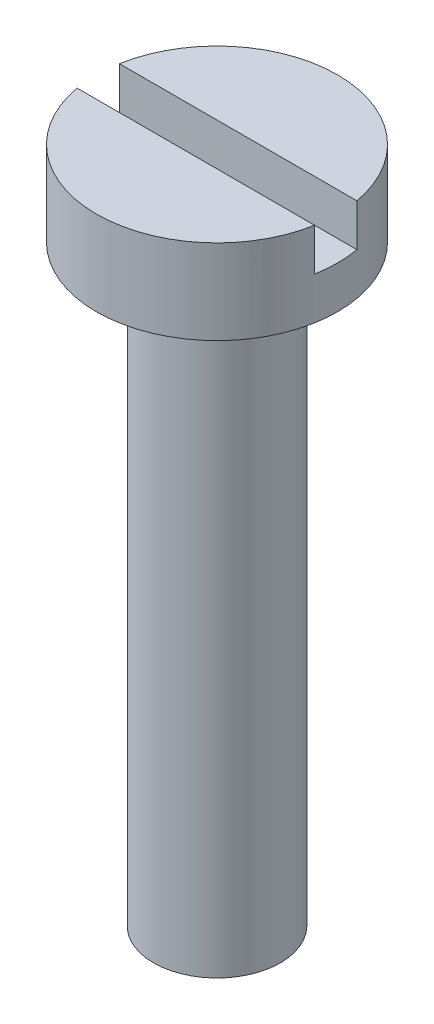
ISO-10303-21;
HEADER;
FILE_DESCRIPTION(('STEP AP214'),'2;1');
FILE_NAME('part.step','',(''),(''),'','','');
FILE_SCHEMA(('AUTOMOTIVE_DESIGN { 1 0 10303 214 1 1 1 1 }'));
ENDSEC;
DATA;
#1=APPLICATION_CONTEXT('core data for automotive mechanical design processes');
#2=APPLICATION_PROTOCOL_DEFINITION('international standard','automotive_design',2000,#1);
#3=PRODUCT_CONTEXT('',#1,'mechanical');
#4=PRODUCT('Part','Part','',(#3));
#5=PRODUCT_RELATED_PRODUCT_CATEGORY('part','',(#4));
#6=PRODUCT_DEFINITION_FORMATION('','',#4);
#7=PRODUCT_DEFINITION_CONTEXT('part definition',#1,'design');
#8=PRODUCT_DEFINITION('design','',#6,#7);
#9=PRODUCT_DEFINITION_SHAPE('','',#8);
#10=(LENGTH_UNIT() NAMED_UNIT(*) SI_UNIT(.MILLI.,.METRE.));
#11=(NAMED_UNIT(*) PLANE_ANGLE_UNIT() SI_UNIT($,.RADIAN.));
#12=(NAMED_UNIT(*) SI_UNIT($,.STERADIAN.) SOLID_ANGLE_UNIT());
#13=UNCERTAINTY_MEASURE_WITH_UNIT(LENGTH_MEASURE(1.E-05),#10,'distance_accuracy_value','');
#14=(GEOMETRIC_REPRESENTATION_CONTEXT(3) GLOBAL_UNCERTAINTY_ASSIGNED_CONTEXT((#13)) GLOBAL_UNIT_ASSIGNED_CONTEXT((#10,
#11,#12)) REPRESENTATION_CONTEXT('',''));
#15=CARTESIAN_POINT('',(0.,0.,0.));
#16=DIRECTION('',(0.,0.,1.));
#17=DIRECTION('',(1.,0.,0.));
#18=AXIS2_PLACEMENT_3D('',#15,#16,#17);
#19=CARTESIAN_POINT('',(0.,2.,0.));
#20=DIRECTION('',(0.,1.,0.));
#21=DIRECTION('',(0.,0.,1.));
#22=AXIS2_PLACEMENT_3D('',#19,#20,#21);
#23=PLANE('',#22);
#24=DIRECTION('',(1.,0.,0.));
#25=VECTOR('',#24,1.);
#26=CARTESIAN_POINT('',(0.,2.,0.5));
#27=LINE('',#26,#25);
#28=CARTESIAN_POINT('',(-2.80579756931964,2.,0.5));
#29=VERTEX_POINT('',#28);
#30=CARTESIAN_POINT('',(2.80579756931964,2.,0.5));
#31=VERTEX_POINT('',#30);
#32=EDGE_CURVE('E83',#29,#31,#27,.T.);
#33=ORIENTED_EDGE('',*,*,#32,.F.);
#34=CARTESIAN_POINT('',(0.,2.,0.));
#35=DIRECTION('',(0.,1.,0.));
#36=DIRECTION('',(0.,0.,1.));
#37=AXIS2_PLACEMENT_3D('',#34,#35,#36);
#38=CIRCLE('',#37,2.85);
#39=EDGE_CURVE('E93',#29,#31,#38,.T.);
#40=ORIENTED_EDGE('',*,*,#39,.T.);
#41=EDGE_LOOP('',(#33,#40));
#42=FACE_BOUND('',#41,.T.);
#43=ADVANCED_FACE('F35',(#42),#23,.T.);
#44=CARTESIAN_POINT('',(0.,2.,0.));
#45=DIRECTION('',(0.,-1.,0.));
#46=DIRECTION('',(0.,0.,-1.));
#47=AXIS2_PLACEMENT_3D('',#44,#45,#46);
#48=CYLINDRICAL_SURFACE('',#47,2.85);
#49=CARTESIAN_POINT('',(0.,1.,0.));
#50=DIRECTION('',(0.,-1.,0.));
#51=DIRECTION('',(0.,0.,-1.));
#52=AXIS2_PLACEMENT_3D('',#49,#50,#51);
#53=CIRCLE('',#52,2.85);
#54=CARTESIAN_POINT('',(2.80579756931964,1.,-0.5));
#55=VERTEX_POINT('',#54);
#56=CARTESIAN_POINT('',(2.80579756931964,1.,0.5));
#57=VERTEX_POINT('',#56);
#58=EDGE_CURVE('E11',#55,#57,#53,.T.);
#59=ORIENTED_EDGE('',*,*,#58,.T.);
#60=DIRECTION('',(0.,-1.,0.));
#61=VECTOR('',#60,1.);
#62=CARTESIAN_POINT('',(2.80579756931964,2.,0.5));
#63=LINE('',#62,#61);
#64=EDGE_CURVE('E58',#57,#31,#63,.F.);
#65=ORIENTED_EDGE('',*,*,#64,.T.);
#66=ORIENTED_EDGE('',*,*,#39,.F.);
#67=DIRECTION('',(0.,-1.,0.));
#68=VECTOR('',#67,1.);
#69=CARTESIAN_POINT('',(-2.80579756931964,2.,0.5));
#70=LINE('',#69,#68);
#71=CARTESIAN_POINT('',(-2.80579756931964,1.,0.5));
#72=VERTEX_POINT('',#71);
#73=EDGE_CURVE('E105',#29,#72,#70,.T.);
#74=ORIENTED_EDGE('',*,*,#73,.T.);
#75=CARTESIAN_POINT('',(-2.80579756931964,1.,-0.5));
#76=VERTEX_POINT('',#75);
#77=EDGE_CURVE('E39',#72,#76,#53,.T.);
#78=ORIENTED_EDGE('',*,*,#77,.T.);
#79=DIRECTION('',(0.,-1.,0.));
#80=VECTOR('',#79,1.);
#81=CARTESIAN_POINT('',(-2.80579756931964,2.,-0.5));
#82=LINE('',#81,#80);
#83=CARTESIAN_POINT('',(-2.80579756931964,2.,-0.5));
#84=VERTEX_POINT('',#83);
#85=EDGE_CURVE('E78',#76,#84,#82,.F.);
#86=ORIENTED_EDGE('',*,*,#85,.T.);
#87=CARTESIAN_POINT('',(2.80579756931964,2.,-0.5));
#88=VERTEX_POINT('',#87);
#89=EDGE_CURVE('E84',#88,#84,#38,.T.);
#90=ORIENTED_EDGE('',*,*,#89,.F.);
#91=DIRECTION('',(0.,-1.,0.));
#92=VECTOR('',#91,1.);
#93=CARTESIAN_POINT('',(2.80579756931964,2.,-0.5));
#94=LINE('',#93,#92);
#95=EDGE_CURVE('E50',#88,#55,#94,.T.);
#96=ORIENTED_EDGE('',*,*,#95,.T.);
#97=EDGE_LOOP('',(#59,#65,#66,#74,#78,#86,#90,#96));
#98=FACE_BOUND('',#97,.T.);
#99=CARTESIAN_POINT('',(0.,0.,0.));
#100=DIRECTION('',(0.,1.,0.));
#101=DIRECTION('',(0.,0.,1.));
#102=AXIS2_PLACEMENT_3D('',#99,#100,#101);
#103=CIRCLE('',#102,2.85);
#104=CARTESIAN_POINT('',(0.,0.,2.85));
#105=VERTEX_POINT('',#104);
#106=EDGE_CURVE('E96',#105,#105,#103,.T.);
#107=ORIENTED_EDGE('',*,*,#106,.T.);
#108=EDGE_LOOP('',(#107));
#109=FACE_BOUND('',#108,.T.);
#110=ADVANCED_FACE('F37',(#98,#109),#48,.T.);
#111=DIRECTION('',(-1.,0.,0.));
#112=VECTOR('',#111,1.);
#113=CARTESIAN_POINT('',(0.,2.,-0.5));
#114=LINE('',#113,#112);
#115=EDGE_CURVE('E75',#88,#84,#114,.T.);
#116=ORIENTED_EDGE('',*,*,#115,.F.);
#117=ORIENTED_EDGE('',*,*,#89,.T.);
#118=EDGE_LOOP('',(#116,#117));
#119=FACE_BOUND('',#118,.T.);
#120=ADVANCED_FACE('F92',(#119),#23,.T.);
#121=CARTESIAN_POINT('',(0.,0.,0.));
#122=DIRECTION('',(0.,1.,0.));
#123=DIRECTION('',(0.,0.,1.));
#124=AXIS2_PLACEMENT_3D('',#121,#122,#123);
#125=PLANE('',#124);
#126=CARTESIAN_POINT('',(0.,0.,0.));
#127=DIRECTION('',(0.,1.,0.));
#128=DIRECTION('',(0.,0.,1.));
#129=AXIS2_PLACEMENT_3D('',#126,#127,#128);
#130=CIRCLE('',#129,1.5);
#131=CARTESIAN_POINT('',(0.,0.,1.5));
#132=VERTEX_POINT('',#131);
#133=EDGE_CURVE('E99',#132,#132,#130,.T.);
#134=ORIENTED_EDGE('',*,*,#133,.T.);
#135=EDGE_LOOP('',(#134));
#136=FACE_BOUND('',#135,.T.);
#137=ORIENTED_EDGE('',*,*,#106,.F.);
#138=EDGE_LOOP('',(#137));
#139=FACE_BOUND('',#138,.T.);
#140=ADVANCED_FACE('F116',(#136,#139),#125,.F.);
#141=CARTESIAN_POINT('',(0.,-14.,0.));
#142=DIRECTION('',(0.,1.,0.));
#143=DIRECTION('',(0.,0.,1.));
#144=AXIS2_PLACEMENT_3D('',#141,#142,#143);
#145=CYLINDRICAL_SURFACE('',#144,1.5);
#146=CARTESIAN_POINT('',(0.,-14.,0.));
#147=DIRECTION('',(0.,1.,0.));
#148=DIRECTION('',(0.,0.,1.));
#149=AXIS2_PLACEMENT_3D('',#146,#147,#148);
#150=CIRCLE('',#149,1.5);
#151=CARTESIAN_POINT('',(0.,-14.,1.5));
#152=VERTEX_POINT('',#151);
#153=EDGE_CURVE('E102',#152,#152,#150,.T.);
#154=ORIENTED_EDGE('',*,*,#153,.T.);
#155=EDGE_LOOP('',(#154));
#156=FACE_BOUND('',#155,.T.);
#157=ORIENTED_EDGE('',*,*,#133,.F.);
#158=EDGE_LOOP('',(#157));
#159=FACE_BOUND('',#158,.T.);
#160=ADVANCED_FACE('F120',(#156,#159),#145,.T.);
#161=CARTESIAN_POINT('',(0.,-14.,0.));
#162=DIRECTION('',(0.,1.,0.));
#163=DIRECTION('',(0.,0.,1.));
#164=AXIS2_PLACEMENT_3D('',#161,#162,#163);
#165=PLANE('',#164);
#166=ORIENTED_EDGE('',*,*,#153,.F.);
#167=EDGE_LOOP('',(#166));
#168=FACE_BOUND('',#167,.T.);
#169=ADVANCED_FACE('F125',(#168),#165,.F.);
#170=CARTESIAN_POINT('',(0.,1.,0.));
#171=DIRECTION('',(0.,-1.,0.));
#172=DIRECTION('',(0.,0.,-1.));
#173=AXIS2_PLACEMENT_3D('',#170,#171,#172);
#174=PLANE('',#173);
#175=DIRECTION('',(-1.,0.,0.));
#176=VECTOR('',#175,1.);
#177=CARTESIAN_POINT('',(-3.,1.,-0.5));
#178=LINE('',#177,#176);
#179=EDGE_CURVE('E137',#55,#76,#178,.T.);
#180=ORIENTED_EDGE('',*,*,#179,.T.);
#181=ORIENTED_EDGE('',*,*,#77,.F.);
#182=DIRECTION('',(1.,0.,0.));
#183=VECTOR('',#182,1.);
#184=CARTESIAN_POINT('',(-3.,1.,0.5));
#185=LINE('',#184,#183);
#186=EDGE_CURVE('E90',#72,#57,#185,.T.);
#187=ORIENTED_EDGE('',*,*,#186,.T.);
#188=ORIENTED_EDGE('',*,*,#58,.F.);
#189=EDGE_LOOP('',(#180,#181,#187,#188));
#190=FACE_BOUND('',#189,.T.);
#191=ADVANCED_FACE('F139',(#190),#174,.F.);
#192=CARTESIAN_POINT('',(-3.,1.,0.5));
#193=DIRECTION('',(0.,0.,1.));
#194=DIRECTION('',(1.,0.,0.));
#195=AXIS2_PLACEMENT_3D('',#192,#193,#194);
#196=PLANE('',#195);
#197=ORIENTED_EDGE('',*,*,#32,.T.);
#198=ORIENTED_EDGE('',*,*,#64,.F.);
#199=ORIENTED_EDGE('',*,*,#186,.F.);
#200=ORIENTED_EDGE('',*,*,#73,.F.);
#201=EDGE_LOOP('',(#197,#198,#199,#200));
#202=FACE_BOUND('',#201,.T.);
#203=ADVANCED_FACE('F104',(#202),#196,.F.);
#204=CARTESIAN_POINT('',(-3.,1.,-0.5));
#205=DIRECTION('',(0.,0.,-1.));
#206=DIRECTION('',(-1.,0.,0.));
#207=AXIS2_PLACEMENT_3D('',#204,#205,#206);
#208=PLANE('',#207);
#209=ORIENTED_EDGE('',*,*,#115,.T.);
#210=ORIENTED_EDGE('',*,*,#85,.F.);
#211=ORIENTED_EDGE('',*,*,#179,.F.);
#212=ORIENTED_EDGE('',*,*,#95,.F.);
#213=EDGE_LOOP('',(#209,#210,#211,#212));
#214=FACE_BOUND('',#213,.T.);
#215=ADVANCED_FACE('F77',(#214),#208,.F.);
#216=CLOSED_SHELL('',(#43,#110,#120,#140,#160,#169,#191,#203,#215));
#217=MANIFOLD_SOLID_BREP('B2',#216);
#218=ADVANCED_BREP_SHAPE_REPRESENTATION('',(#18,#217),#14);
#219=SHAPE_DEFINITION_REPRESENTATION(#9,#218);
ENDSEC;
END-ISO-10303-21;
